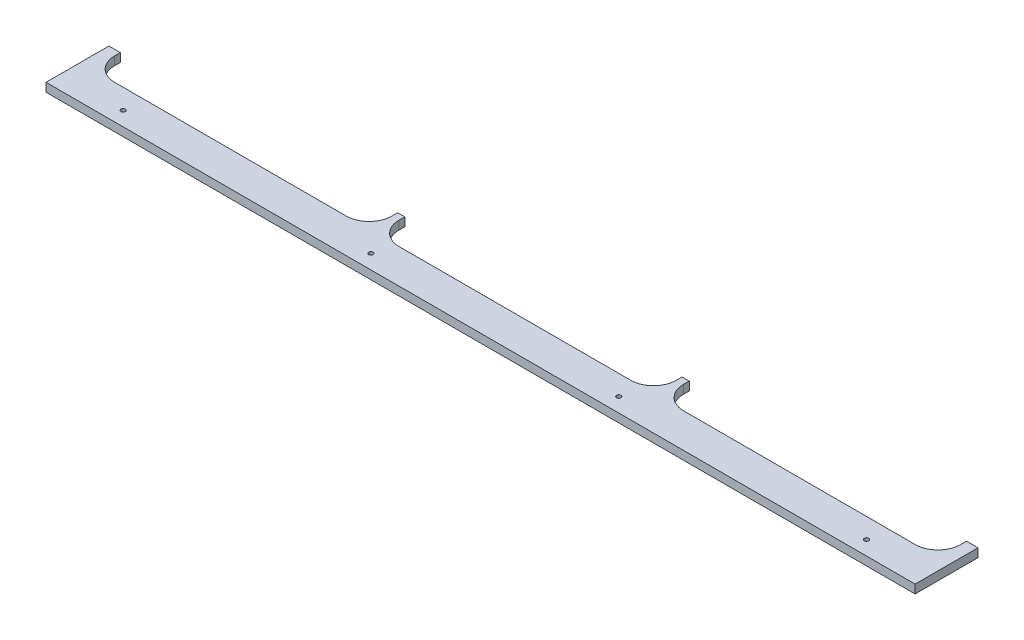
ISO-10303-21;
HEADER;
FILE_DESCRIPTION(('STEP AP214'),'2;1');
FILE_NAME('part.step','',(''),(''),'','','');
FILE_SCHEMA(('AUTOMOTIVE_DESIGN { 1 0 10303 214 1 1 1 1 }'));
ENDSEC;
DATA;
#1=APPLICATION_CONTEXT('core data for automotive mechanical design processes');
#2=APPLICATION_PROTOCOL_DEFINITION('international standard','automotive_design',2000,#1);
#3=PRODUCT_CONTEXT('',#1,'mechanical');
#4=PRODUCT('Part','Part','',(#3));
#5=PRODUCT_RELATED_PRODUCT_CATEGORY('part','',(#4));
#6=PRODUCT_DEFINITION_FORMATION('','',#4);
#7=PRODUCT_DEFINITION_CONTEXT('part definition',#1,'design');
#8=PRODUCT_DEFINITION('design','',#6,#7);
#9=PRODUCT_DEFINITION_SHAPE('','',#8);
#10=(LENGTH_UNIT() NAMED_UNIT(*) SI_UNIT(.MILLI.,.METRE.));
#11=(NAMED_UNIT(*) PLANE_ANGLE_UNIT() SI_UNIT($,.RADIAN.));
#12=(NAMED_UNIT(*) SI_UNIT($,.STERADIAN.) SOLID_ANGLE_UNIT());
#13=UNCERTAINTY_MEASURE_WITH_UNIT(LENGTH_MEASURE(1.E-05),#10,'distance_accuracy_value','');
#14=(GEOMETRIC_REPRESENTATION_CONTEXT(3) GLOBAL_UNCERTAINTY_ASSIGNED_CONTEXT((#13)) GLOBAL_UNIT_ASSIGNED_CONTEXT((#10,
#11,#12)) REPRESENTATION_CONTEXT('',''));
#15=CARTESIAN_POINT('',(0.,0.,0.));
#16=DIRECTION('',(0.,0.,1.));
#17=DIRECTION('',(1.,0.,0.));
#18=AXIS2_PLACEMENT_3D('',#15,#16,#17);
#19=CARTESIAN_POINT('',(38.0999999999999,9.525,-63.4999999999999));
#20=DIRECTION('',(0.,1.,0.));
#21=DIRECTION('',(0.,0.,1.));
#22=AXIS2_PLACEMENT_3D('',#19,#20,#21);
#23=PLANE('',#22);
#24=CARTESIAN_POINT('',(895.35,9.525,-15.875));
#25=DIRECTION('',(0.,1.,0.));
#26=DIRECTION('',(0.,0.,-1.));
#27=AXIS2_PLACEMENT_3D('',#24,#25,#26);
#28=CIRCLE('',#27,2.45744999999989);
#29=CARTESIAN_POINT('',(895.35,9.525,-18.3324499999999));
#30=VERTEX_POINT('',#29);
#31=EDGE_CURVE('E425',#30,#30,#28,.T.);
#32=ORIENTED_EDGE('',*,*,#31,.F.);
#33=EDGE_LOOP('',(#32));
#34=FACE_BOUND('',#33,.T.);
#35=CARTESIAN_POINT('',(69.85,9.525,-15.875));
#36=DIRECTION('',(0.,1.,0.));
#37=DIRECTION('',(0.,0.,1.));
#38=AXIS2_PLACEMENT_3D('',#35,#36,#37);
#39=CIRCLE('',#38,2.45745);
#40=CARTESIAN_POINT('',(69.85,9.525,-13.41755));
#41=VERTEX_POINT('',#40);
#42=EDGE_CURVE('E222',#41,#41,#39,.T.);
#43=ORIENTED_EDGE('',*,*,#42,.F.);
#44=EDGE_LOOP('',(#43));
#45=FACE_BOUND('',#44,.T.);
#46=DIRECTION('',(0.,0.,1.));
#47=VECTOR('',#46,1.);
#48=CARTESIAN_POINT('',(0.,9.525,0.));
#49=LINE('',#48,#47);
#50=CARTESIAN_POINT('',(0.,9.525,-69.85));
#51=VERTEX_POINT('',#50);
#52=CARTESIAN_POINT('',(0.,9.525,0.));
#53=VERTEX_POINT('',#52);
#54=EDGE_CURVE('E261',#51,#53,#49,.T.);
#55=ORIENTED_EDGE('',*,*,#54,.T.);
#56=DIRECTION('',(1.,0.,0.));
#57=VECTOR('',#56,1.);
#58=CARTESIAN_POINT('',(0.,9.525,0.));
#59=LINE('',#58,#57);
#60=CARTESIAN_POINT('',(965.2,9.525,0.));
#61=VERTEX_POINT('',#60);
#62=EDGE_CURVE('E139',#53,#61,#59,.T.);
#63=ORIENTED_EDGE('',*,*,#62,.T.);
#64=DIRECTION('',(0.,0.,-1.));
#65=VECTOR('',#64,1.);
#66=CARTESIAN_POINT('',(965.2,9.525,0.));
#67=LINE('',#66,#65);
#68=CARTESIAN_POINT('',(965.2,9.525,-69.85));
#69=VERTEX_POINT('',#68);
#70=EDGE_CURVE('E318',#61,#69,#67,.T.);
#71=ORIENTED_EDGE('',*,*,#70,.T.);
#72=DIRECTION('',(-1.,0.,0.));
#73=VECTOR('',#72,1.);
#74=CARTESIAN_POINT('',(952.5,9.525,-69.85));
#75=LINE('',#74,#73);
#76=CARTESIAN_POINT('',(952.5,9.525,-69.85));
#77=VERTEX_POINT('',#76);
#78=EDGE_CURVE('E337',#69,#77,#75,.T.);
#79=ORIENTED_EDGE('',*,*,#78,.T.);
#80=DIRECTION('',(0.,0.,1.));
#81=VECTOR('',#80,1.);
#82=CARTESIAN_POINT('',(952.5,9.525,-63.5));
#83=LINE('',#82,#81);
#84=CARTESIAN_POINT('',(952.5,9.525,-63.5));
#85=VERTEX_POINT('',#84);
#86=EDGE_CURVE('E334',#77,#85,#83,.T.);
#87=ORIENTED_EDGE('',*,*,#86,.T.);
#88=CARTESIAN_POINT('',(927.1,9.525,-63.5));
#89=DIRECTION('',(0.,-1.,0.));
#90=DIRECTION('',(0.,0.,1.));
#91=AXIS2_PLACEMENT_3D('',#88,#89,#90);
#92=CIRCLE('',#91,25.4);
#93=CARTESIAN_POINT('',(927.1,9.525,-38.1));
#94=VERTEX_POINT('',#93);
#95=EDGE_CURVE('E336',#85,#94,#92,.T.);
#96=ORIENTED_EDGE('',*,*,#95,.T.);
#97=DIRECTION('',(-1.,0.,0.));
#98=VECTOR('',#97,1.);
#99=CARTESIAN_POINT('',(669.925,9.525,-38.1));
#100=LINE('',#99,#98);
#101=CARTESIAN_POINT('',(669.925,9.525,-38.1));
#102=VERTEX_POINT('',#101);
#103=EDGE_CURVE('E339',#94,#102,#100,.T.);
#104=ORIENTED_EDGE('',*,*,#103,.T.);
#105=CARTESIAN_POINT('',(669.925,9.525,-63.5));
#106=DIRECTION('',(0.,-1.,0.));
#107=DIRECTION('',(0.,0.,-1.));
#108=AXIS2_PLACEMENT_3D('',#105,#106,#107);
#109=CIRCLE('',#108,25.4);
#110=CARTESIAN_POINT('',(644.525,9.525,-63.5));
#111=VERTEX_POINT('',#110);
#112=EDGE_CURVE('E345',#102,#111,#109,.T.);
#113=ORIENTED_EDGE('',*,*,#112,.T.);
#114=DIRECTION('',(0.,0.,-1.));
#115=VECTOR('',#114,1.);
#116=CARTESIAN_POINT('',(644.525,9.525,-63.5));
#117=LINE('',#116,#115);
#118=CARTESIAN_POINT('',(644.525,9.525,-69.85));
#119=VERTEX_POINT('',#118);
#120=EDGE_CURVE('E347',#111,#119,#117,.T.);
#121=ORIENTED_EDGE('',*,*,#120,.T.);
#122=DIRECTION('',(-1.,0.,0.));
#123=VECTOR('',#122,1.);
#124=CARTESIAN_POINT('',(636.5875,9.525,-69.85));
#125=LINE('',#124,#123);
#126=CARTESIAN_POINT('',(636.5875,9.525,-69.85));
#127=VERTEX_POINT('',#126);
#128=EDGE_CURVE('E349',#119,#127,#125,.T.);
#129=ORIENTED_EDGE('',*,*,#128,.T.);
#130=DIRECTION('',(0.,0.,1.));
#131=VECTOR('',#130,1.);
#132=CARTESIAN_POINT('',(636.5875,9.525,-69.85));
#133=LINE('',#132,#131);
#134=CARTESIAN_POINT('',(636.5875,9.525,-63.5));
#135=VERTEX_POINT('',#134);
#136=EDGE_CURVE('E351',#127,#135,#133,.T.);
#137=ORIENTED_EDGE('',*,*,#136,.T.);
#138=CARTESIAN_POINT('',(611.1875,9.525,-63.5));
#139=DIRECTION('',(0.,-1.,0.));
#140=DIRECTION('',(0.,0.,1.));
#141=AXIS2_PLACEMENT_3D('',#138,#139,#140);
#142=CIRCLE('',#141,25.4);
#143=CARTESIAN_POINT('',(611.1875,9.525,-38.1));
#144=VERTEX_POINT('',#143);
#145=EDGE_CURVE('E353',#135,#144,#142,.T.);
#146=ORIENTED_EDGE('',*,*,#145,.T.);
#147=DIRECTION('',(-1.,0.,0.));
#148=VECTOR('',#147,1.);
#149=CARTESIAN_POINT('',(354.0125,9.525,-38.1));
#150=LINE('',#149,#148);
#151=CARTESIAN_POINT('',(354.0125,9.525,-38.1));
#152=VERTEX_POINT('',#151);
#153=EDGE_CURVE('E355',#144,#152,#150,.T.);
#154=ORIENTED_EDGE('',*,*,#153,.T.);
#155=CARTESIAN_POINT('',(354.0125,9.525,-63.5));
#156=DIRECTION('',(0.,-1.,0.));
#157=DIRECTION('',(0.,0.,1.));
#158=AXIS2_PLACEMENT_3D('',#155,#156,#157);
#159=CIRCLE('',#158,25.4);
#160=CARTESIAN_POINT('',(328.6125,9.525,-63.5));
#161=VERTEX_POINT('',#160);
#162=EDGE_CURVE('E357',#152,#161,#159,.T.);
#163=ORIENTED_EDGE('',*,*,#162,.T.);
#164=DIRECTION('',(0.,0.,-1.));
#165=VECTOR('',#164,1.);
#166=CARTESIAN_POINT('',(328.6125,9.525,-69.85));
#167=LINE('',#166,#165);
#168=CARTESIAN_POINT('',(328.6125,9.525,-69.85));
#169=VERTEX_POINT('',#168);
#170=EDGE_CURVE('E359',#161,#169,#167,.T.);
#171=ORIENTED_EDGE('',*,*,#170,.T.);
#172=DIRECTION('',(-1.,0.,0.));
#173=VECTOR('',#172,1.);
#174=CARTESIAN_POINT('',(328.6125,9.525,-69.85));
#175=LINE('',#174,#173);
#176=CARTESIAN_POINT('',(320.675,9.525,-69.85));
#177=VERTEX_POINT('',#176);
#178=EDGE_CURVE('E361',#169,#177,#175,.T.);
#179=ORIENTED_EDGE('',*,*,#178,.T.);
#180=DIRECTION('',(0.,0.,1.));
#181=VECTOR('',#180,1.);
#182=CARTESIAN_POINT('',(320.675,9.525,-69.85));
#183=LINE('',#182,#181);
#184=CARTESIAN_POINT('',(320.675,9.525,-63.5000000000001));
#185=VERTEX_POINT('',#184);
#186=EDGE_CURVE('E363',#177,#185,#183,.T.);
#187=ORIENTED_EDGE('',*,*,#186,.T.);
#188=CARTESIAN_POINT('',(295.275,9.525,-63.4999999999999));
#189=DIRECTION('',(0.,-1.,0.));
#190=DIRECTION('',(0.,0.,1.));
#191=AXIS2_PLACEMENT_3D('',#188,#189,#190);
#192=CIRCLE('',#191,25.4);
#193=CARTESIAN_POINT('',(295.275,9.525,-38.1));
#194=VERTEX_POINT('',#193);
#195=EDGE_CURVE('E365',#185,#194,#192,.T.);
#196=ORIENTED_EDGE('',*,*,#195,.T.);
#197=DIRECTION('',(-1.,0.,0.));
#198=VECTOR('',#197,1.);
#199=CARTESIAN_POINT('',(38.1000000000001,9.525,-38.1));
#200=LINE('',#199,#198);
#201=CARTESIAN_POINT('',(38.1000000000001,9.525,-38.1));
#202=VERTEX_POINT('',#201);
#203=EDGE_CURVE('E200',#194,#202,#200,.T.);
#204=ORIENTED_EDGE('',*,*,#203,.T.);
#205=CARTESIAN_POINT('',(38.0999999999999,9.525,-63.4999999999999));
#206=DIRECTION('',(0.,-1.,0.));
#207=DIRECTION('',(0.,0.,1.));
#208=AXIS2_PLACEMENT_3D('',#205,#206,#207);
#209=CIRCLE('',#208,25.4);
#210=CARTESIAN_POINT('',(12.6999999999999,9.525,-63.5000000000002));
#211=VERTEX_POINT('',#210);
#212=EDGE_CURVE('E194',#202,#211,#209,.T.);
#213=ORIENTED_EDGE('',*,*,#212,.T.);
#214=DIRECTION('',(0.,0.,-1.));
#215=VECTOR('',#214,1.);
#216=CARTESIAN_POINT('',(12.6999999999999,9.525,-69.85));
#217=LINE('',#216,#215);
#218=CARTESIAN_POINT('',(12.6999999999999,9.525,-69.85));
#219=VERTEX_POINT('',#218);
#220=EDGE_CURVE('E198',#211,#219,#217,.T.);
#221=ORIENTED_EDGE('',*,*,#220,.T.);
#222=DIRECTION('',(-1.,0.,0.));
#223=VECTOR('',#222,1.);
#224=CARTESIAN_POINT('',(12.6999999999999,9.525,-69.85));
#225=LINE('',#224,#223);
#226=EDGE_CURVE('E54',#219,#51,#225,.T.);
#227=ORIENTED_EDGE('',*,*,#226,.T.);
#228=EDGE_LOOP('',(#55,#63,#71,#79,#87,#96,#104,#113,#121,#129,#137,#146,#154,#163,#171,#179,
#187,#196,#204,#213,#221,#227));
#229=FACE_BOUND('',#228,.T.);
#230=CARTESIAN_POINT('',(345.01582,9.525,-15.875));
#231=DIRECTION('',(0.,1.,0.));
#232=DIRECTION('',(0.,0.,1.));
#233=AXIS2_PLACEMENT_3D('',#230,#231,#232);
#234=CIRCLE('',#233,2.45745000000002);
#235=CARTESIAN_POINT('',(345.01582,9.525,-13.41755));
#236=VERTEX_POINT('',#235);
#237=EDGE_CURVE('E431',#236,#236,#234,.T.);
#238=ORIENTED_EDGE('',*,*,#237,.F.);
#239=EDGE_LOOP('',(#238));
#240=FACE_BOUND('',#239,.T.);
#241=CARTESIAN_POINT('',(620.18418,9.525,-15.875));
#242=DIRECTION('',(0.,1.,0.));
#243=DIRECTION('',(0.,0.,-1.));
#244=AXIS2_PLACEMENT_3D('',#241,#242,#243);
#245=CIRCLE('',#244,2.45745000000001);
#246=CARTESIAN_POINT('',(620.18418,9.525,-18.33245));
#247=VERTEX_POINT('',#246);
#248=EDGE_CURVE('E416',#247,#247,#245,.T.);
#249=ORIENTED_EDGE('',*,*,#248,.F.);
#250=EDGE_LOOP('',(#249));
#251=FACE_BOUND('',#250,.T.);
#252=ADVANCED_FACE('F37',(#34,#45,#229,#240,#251),#23,.T.);
#253=CARTESIAN_POINT('',(38.0999999999999,0.,-63.4999999999999));
#254=DIRECTION('',(0.,1.,0.));
#255=DIRECTION('',(0.,0.,1.));
#256=AXIS2_PLACEMENT_3D('',#253,#254,#255);
#257=PLANE('',#256);
#258=DIRECTION('',(0.,0.,1.));
#259=VECTOR('',#258,1.);
#260=CARTESIAN_POINT('',(0.,0.,0.));
#261=LINE('',#260,#259);
#262=CARTESIAN_POINT('',(0.,0.,-69.85));
#263=VERTEX_POINT('',#262);
#264=CARTESIAN_POINT('',(0.,0.,0.));
#265=VERTEX_POINT('',#264);
#266=EDGE_CURVE('E218',#263,#265,#261,.T.);
#267=ORIENTED_EDGE('',*,*,#266,.F.);
#268=DIRECTION('',(-1.,0.,0.));
#269=VECTOR('',#268,1.);
#270=CARTESIAN_POINT('',(12.6999999999999,0.,-69.85));
#271=LINE('',#270,#269);
#272=CARTESIAN_POINT('',(12.6999999999999,0.,-69.85));
#273=VERTEX_POINT('',#272);
#274=EDGE_CURVE('E131',#273,#263,#271,.T.);
#275=ORIENTED_EDGE('',*,*,#274,.F.);
#276=DIRECTION('',(0.,0.,-1.));
#277=VECTOR('',#276,1.);
#278=CARTESIAN_POINT('',(12.6999999999999,0.,-69.85));
#279=LINE('',#278,#277);
#280=CARTESIAN_POINT('',(12.6999999999999,0.,-63.5000000000002));
#281=VERTEX_POINT('',#280);
#282=EDGE_CURVE('E125',#281,#273,#279,.T.);
#283=ORIENTED_EDGE('',*,*,#282,.F.);
#284=CARTESIAN_POINT('',(38.0999999999999,0.,-63.4999999999999));
#285=DIRECTION('',(0.,-1.,0.));
#286=DIRECTION('',(0.,0.,1.));
#287=AXIS2_PLACEMENT_3D('',#284,#285,#286);
#288=CIRCLE('',#287,25.4);
#289=CARTESIAN_POINT('',(38.1000000000001,0.,-38.1));
#290=VERTEX_POINT('',#289);
#291=EDGE_CURVE('E208',#290,#281,#288,.T.);
#292=ORIENTED_EDGE('',*,*,#291,.F.);
#293=DIRECTION('',(-1.,0.,0.));
#294=VECTOR('',#293,1.);
#295=CARTESIAN_POINT('',(38.1000000000001,0.,-38.1));
#296=LINE('',#295,#294);
#297=CARTESIAN_POINT('',(295.275,0.,-38.1));
#298=VERTEX_POINT('',#297);
#299=EDGE_CURVE('E256',#298,#290,#296,.T.);
#300=ORIENTED_EDGE('',*,*,#299,.F.);
#301=CARTESIAN_POINT('',(295.275,0.,-63.4999999999999));
#302=DIRECTION('',(0.,-1.,0.));
#303=DIRECTION('',(0.,0.,1.));
#304=AXIS2_PLACEMENT_3D('',#301,#302,#303);
#305=CIRCLE('',#304,25.4);
#306=CARTESIAN_POINT('',(320.675,0.,-63.5000000000001));
#307=VERTEX_POINT('',#306);
#308=EDGE_CURVE('E254',#307,#298,#305,.T.);
#309=ORIENTED_EDGE('',*,*,#308,.F.);
#310=DIRECTION('',(0.,0.,1.));
#311=VECTOR('',#310,1.);
#312=CARTESIAN_POINT('',(320.675,0.,-69.85));
#313=LINE('',#312,#311);
#314=CARTESIAN_POINT('',(320.675,0.,-69.85));
#315=VERTEX_POINT('',#314);
#316=EDGE_CURVE('E252',#315,#307,#313,.T.);
#317=ORIENTED_EDGE('',*,*,#316,.F.);
#318=DIRECTION('',(-1.,0.,0.));
#319=VECTOR('',#318,1.);
#320=CARTESIAN_POINT('',(328.6125,0.,-69.85));
#321=LINE('',#320,#319);
#322=CARTESIAN_POINT('',(328.6125,0.,-69.85));
#323=VERTEX_POINT('',#322);
#324=EDGE_CURVE('E250',#323,#315,#321,.T.);
#325=ORIENTED_EDGE('',*,*,#324,.F.);
#326=DIRECTION('',(0.,0.,-1.));
#327=VECTOR('',#326,1.);
#328=CARTESIAN_POINT('',(328.6125,0.,-69.85));
#329=LINE('',#328,#327);
#330=CARTESIAN_POINT('',(328.6125,0.,-63.5));
#331=VERTEX_POINT('',#330);
#332=EDGE_CURVE('E248',#331,#323,#329,.T.);
#333=ORIENTED_EDGE('',*,*,#332,.F.);
#334=CARTESIAN_POINT('',(354.0125,0.,-63.5));
#335=DIRECTION('',(0.,-1.,0.));
#336=DIRECTION('',(0.,0.,1.));
#337=AXIS2_PLACEMENT_3D('',#334,#335,#336);
#338=CIRCLE('',#337,25.4);
#339=CARTESIAN_POINT('',(354.0125,0.,-38.1));
#340=VERTEX_POINT('',#339);
#341=EDGE_CURVE('E246',#340,#331,#338,.T.);
#342=ORIENTED_EDGE('',*,*,#341,.F.);
#343=DIRECTION('',(-1.,0.,0.));
#344=VECTOR('',#343,1.);
#345=CARTESIAN_POINT('',(354.0125,0.,-38.1));
#346=LINE('',#345,#344);
#347=CARTESIAN_POINT('',(611.1875,0.,-38.1));
#348=VERTEX_POINT('',#347);
#349=EDGE_CURVE('E244',#348,#340,#346,.T.);
#350=ORIENTED_EDGE('',*,*,#349,.F.);
#351=CARTESIAN_POINT('',(611.1875,0.,-63.5));
#352=DIRECTION('',(0.,-1.,0.));
#353=DIRECTION('',(0.,0.,1.));
#354=AXIS2_PLACEMENT_3D('',#351,#352,#353);
#355=CIRCLE('',#354,25.4);
#356=CARTESIAN_POINT('',(636.5875,0.,-63.5));
#357=VERTEX_POINT('',#356);
#358=EDGE_CURVE('E242',#357,#348,#355,.T.);
#359=ORIENTED_EDGE('',*,*,#358,.F.);
#360=DIRECTION('',(0.,0.,1.));
#361=VECTOR('',#360,1.);
#362=CARTESIAN_POINT('',(636.5875,0.,-69.85));
#363=LINE('',#362,#361);
#364=CARTESIAN_POINT('',(636.5875,0.,-69.85));
#365=VERTEX_POINT('',#364);
#366=EDGE_CURVE('E240',#365,#357,#363,.T.);
#367=ORIENTED_EDGE('',*,*,#366,.F.);
#368=DIRECTION('',(-1.,0.,0.));
#369=VECTOR('',#368,1.);
#370=CARTESIAN_POINT('',(636.5875,0.,-69.85));
#371=LINE('',#370,#369);
#372=CARTESIAN_POINT('',(644.525,0.,-69.85));
#373=VERTEX_POINT('',#372);
#374=EDGE_CURVE('E238',#373,#365,#371,.T.);
#375=ORIENTED_EDGE('',*,*,#374,.F.);
#376=DIRECTION('',(0.,0.,-1.));
#377=VECTOR('',#376,1.);
#378=CARTESIAN_POINT('',(644.525,0.,-63.5));
#379=LINE('',#378,#377);
#380=CARTESIAN_POINT('',(644.525,0.,-63.5));
#381=VERTEX_POINT('',#380);
#382=EDGE_CURVE('E236',#381,#373,#379,.T.);
#383=ORIENTED_EDGE('',*,*,#382,.F.);
#384=CARTESIAN_POINT('',(669.925,0.,-63.5));
#385=DIRECTION('',(0.,-1.,0.));
#386=DIRECTION('',(0.,0.,-1.));
#387=AXIS2_PLACEMENT_3D('',#384,#385,#386);
#388=CIRCLE('',#387,25.4);
#389=CARTESIAN_POINT('',(669.925,0.,-38.1));
#390=VERTEX_POINT('',#389);
#391=EDGE_CURVE('E234',#390,#381,#388,.T.);
#392=ORIENTED_EDGE('',*,*,#391,.F.);
#393=DIRECTION('',(-1.,0.,0.));
#394=VECTOR('',#393,1.);
#395=CARTESIAN_POINT('',(669.925,0.,-38.1));
#396=LINE('',#395,#394);
#397=CARTESIAN_POINT('',(927.1,0.,-38.1));
#398=VERTEX_POINT('',#397);
#399=EDGE_CURVE('E232',#398,#390,#396,.T.);
#400=ORIENTED_EDGE('',*,*,#399,.F.);
#401=CARTESIAN_POINT('',(927.1,0.,-63.5));
#402=DIRECTION('',(0.,-1.,0.));
#403=DIRECTION('',(0.,0.,1.));
#404=AXIS2_PLACEMENT_3D('',#401,#402,#403);
#405=CIRCLE('',#404,25.4);
#406=CARTESIAN_POINT('',(952.5,0.,-63.5));
#407=VERTEX_POINT('',#406);
#408=EDGE_CURVE('E230',#407,#398,#405,.T.);
#409=ORIENTED_EDGE('',*,*,#408,.F.);
#410=DIRECTION('',(0.,0.,1.));
#411=VECTOR('',#410,1.);
#412=CARTESIAN_POINT('',(952.5,0.,-63.5));
#413=LINE('',#412,#411);
#414=CARTESIAN_POINT('',(952.5,0.,-69.85));
#415=VERTEX_POINT('',#414);
#416=EDGE_CURVE('E228',#415,#407,#413,.T.);
#417=ORIENTED_EDGE('',*,*,#416,.F.);
#418=DIRECTION('',(-1.,0.,0.));
#419=VECTOR('',#418,1.);
#420=CARTESIAN_POINT('',(952.5,0.,-69.85));
#421=LINE('',#420,#419);
#422=CARTESIAN_POINT('',(965.2,0.,-69.85));
#423=VERTEX_POINT('',#422);
#424=EDGE_CURVE('E226',#423,#415,#421,.T.);
#425=ORIENTED_EDGE('',*,*,#424,.F.);
#426=DIRECTION('',(0.,0.,-1.));
#427=VECTOR('',#426,1.);
#428=CARTESIAN_POINT('',(965.2,0.,0.));
#429=LINE('',#428,#427);
#430=CARTESIAN_POINT('',(965.2,0.,0.));
#431=VERTEX_POINT('',#430);
#432=EDGE_CURVE('E224',#431,#423,#429,.T.);
#433=ORIENTED_EDGE('',*,*,#432,.F.);
#434=DIRECTION('',(1.,0.,0.));
#435=VECTOR('',#434,1.);
#436=CARTESIAN_POINT('',(0.,0.,0.));
#437=LINE('',#436,#435);
#438=EDGE_CURVE('E221',#265,#431,#437,.T.);
#439=ORIENTED_EDGE('',*,*,#438,.F.);
#440=EDGE_LOOP('',(#267,#275,#283,#292,#300,#309,#317,#325,#333,#342,#350,#359,#367,#375,#383,
#392,#400,#409,#417,#425,#433,#439));
#441=FACE_BOUND('',#440,.T.);
#442=CARTESIAN_POINT('',(69.85,0.,-15.875));
#443=DIRECTION('',(0.,1.,0.));
#444=DIRECTION('',(0.,0.,1.));
#445=AXIS2_PLACEMENT_3D('',#442,#443,#444);
#446=CIRCLE('',#445,2.45745);
#447=CARTESIAN_POINT('',(69.85,0.,-13.41755));
#448=VERTEX_POINT('',#447);
#449=EDGE_CURVE('E434',#448,#448,#446,.T.);
#450=ORIENTED_EDGE('',*,*,#449,.T.);
#451=EDGE_LOOP('',(#450));
#452=FACE_BOUND('',#451,.T.);
#453=CARTESIAN_POINT('',(345.01582,0.,-15.875));
#454=DIRECTION('',(0.,1.,0.));
#455=DIRECTION('',(0.,0.,1.));
#456=AXIS2_PLACEMENT_3D('',#453,#454,#455);
#457=CIRCLE('',#456,2.45745000000002);
#458=CARTESIAN_POINT('',(345.01582,0.,-13.41755));
#459=VERTEX_POINT('',#458);
#460=EDGE_CURVE('E428',#459,#459,#457,.T.);
#461=ORIENTED_EDGE('',*,*,#460,.T.);
#462=EDGE_LOOP('',(#461));
#463=FACE_BOUND('',#462,.T.);
#464=CARTESIAN_POINT('',(895.35,0.,-15.875));
#465=DIRECTION('',(0.,1.,0.));
#466=DIRECTION('',(0.,0.,-1.));
#467=AXIS2_PLACEMENT_3D('',#464,#465,#466);
#468=CIRCLE('',#467,2.45744999999989);
#469=CARTESIAN_POINT('',(895.35,0.,-18.3324499999999));
#470=VERTEX_POINT('',#469);
#471=EDGE_CURVE('E422',#470,#470,#468,.T.);
#472=ORIENTED_EDGE('',*,*,#471,.T.);
#473=EDGE_LOOP('',(#472));
#474=FACE_BOUND('',#473,.T.);
#475=CARTESIAN_POINT('',(620.18418,0.,-15.875));
#476=DIRECTION('',(0.,1.,0.));
#477=DIRECTION('',(0.,0.,-1.));
#478=AXIS2_PLACEMENT_3D('',#475,#476,#477);
#479=CIRCLE('',#478,2.45745000000001);
#480=CARTESIAN_POINT('',(620.18418,0.,-18.33245));
#481=VERTEX_POINT('',#480);
#482=EDGE_CURVE('E419',#481,#481,#479,.T.);
#483=ORIENTED_EDGE('',*,*,#482,.T.);
#484=EDGE_LOOP('',(#483));
#485=FACE_BOUND('',#484,.T.);
#486=ADVANCED_FACE('F322',(#441,#452,#463,#474,#485),#257,.F.);
#487=CARTESIAN_POINT('',(0.,9.525,0.));
#488=DIRECTION('',(1.,0.,0.));
#489=DIRECTION('',(0.,0.,-1.));
#490=AXIS2_PLACEMENT_3D('',#487,#488,#489);
#491=PLANE('',#490);
#492=ORIENTED_EDGE('',*,*,#266,.T.);
#493=DIRECTION('',(0.,-1.,0.));
#494=VECTOR('',#493,1.);
#495=CARTESIAN_POINT('',(0.,9.525,0.));
#496=LINE('',#495,#494);
#497=EDGE_CURVE('E11',#53,#265,#496,.T.);
#498=ORIENTED_EDGE('',*,*,#497,.F.);
#499=ORIENTED_EDGE('',*,*,#54,.F.);
#500=DIRECTION('',(0.,-1.,0.));
#501=VECTOR('',#500,1.);
#502=CARTESIAN_POINT('',(0.,9.525,-69.85));
#503=LINE('',#502,#501);
#504=EDGE_CURVE('E214',#51,#263,#503,.T.);
#505=ORIENTED_EDGE('',*,*,#504,.T.);
#506=EDGE_LOOP('',(#492,#498,#499,#505));
#507=FACE_BOUND('',#506,.T.);
#508=ADVANCED_FACE('F39',(#507),#491,.F.);
#509=CARTESIAN_POINT('',(0.,9.525,0.));
#510=DIRECTION('',(0.,0.,-1.));
#511=DIRECTION('',(-1.,0.,0.));
#512=AXIS2_PLACEMENT_3D('',#509,#510,#511);
#513=PLANE('',#512);
#514=ORIENTED_EDGE('',*,*,#438,.T.);
#515=DIRECTION('',(0.,-1.,0.));
#516=VECTOR('',#515,1.);
#517=CARTESIAN_POINT('',(965.2,9.525,0.));
#518=LINE('',#517,#516);
#519=EDGE_CURVE('E46',#61,#431,#518,.T.);
#520=ORIENTED_EDGE('',*,*,#519,.F.);
#521=ORIENTED_EDGE('',*,*,#62,.F.);
#522=ORIENTED_EDGE('',*,*,#497,.T.);
#523=EDGE_LOOP('',(#514,#520,#521,#522));
#524=FACE_BOUND('',#523,.T.);
#525=ADVANCED_FACE('F664',(#524),#513,.F.);
#526=CARTESIAN_POINT('',(965.2,9.525,0.));
#527=DIRECTION('',(-1.,0.,0.));
#528=DIRECTION('',(0.,0.,1.));
#529=AXIS2_PLACEMENT_3D('',#526,#527,#528);
#530=PLANE('',#529);
#531=ORIENTED_EDGE('',*,*,#432,.T.);
#532=DIRECTION('',(0.,-1.,0.));
#533=VECTOR('',#532,1.);
#534=CARTESIAN_POINT('',(965.2,9.525,-69.85));
#535=LINE('',#534,#533);
#536=EDGE_CURVE('E310',#69,#423,#535,.T.);
#537=ORIENTED_EDGE('',*,*,#536,.F.);
#538=ORIENTED_EDGE('',*,*,#70,.F.);
#539=ORIENTED_EDGE('',*,*,#519,.T.);
#540=EDGE_LOOP('',(#531,#537,#538,#539));
#541=FACE_BOUND('',#540,.T.);
#542=ADVANCED_FACE('F316',(#541),#530,.F.);
#543=CARTESIAN_POINT('',(952.5,9.525,-69.85));
#544=DIRECTION('',(0.,0.,1.));
#545=DIRECTION('',(1.,0.,0.));
#546=AXIS2_PLACEMENT_3D('',#543,#544,#545);
#547=PLANE('',#546);
#548=ORIENTED_EDGE('',*,*,#424,.T.);
#549=DIRECTION('',(0.,-1.,0.));
#550=VECTOR('',#549,1.);
#551=CARTESIAN_POINT('',(952.5,9.525,-69.85));
#552=LINE('',#551,#550);
#553=EDGE_CURVE('E307',#77,#415,#552,.T.);
#554=ORIENTED_EDGE('',*,*,#553,.F.);
#555=ORIENTED_EDGE('',*,*,#78,.F.);
#556=ORIENTED_EDGE('',*,*,#536,.T.);
#557=EDGE_LOOP('',(#548,#554,#555,#556));
#558=FACE_BOUND('',#557,.T.);
#559=ADVANCED_FACE('F328',(#558),#547,.F.);
#560=CARTESIAN_POINT('',(952.5,9.525,-63.5));
#561=DIRECTION('',(1.,0.,0.));
#562=DIRECTION('',(0.,0.,-1.));
#563=AXIS2_PLACEMENT_3D('',#560,#561,#562);
#564=PLANE('',#563);
#565=ORIENTED_EDGE('',*,*,#416,.T.);
#566=DIRECTION('',(0.,-1.,0.));
#567=VECTOR('',#566,1.);
#568=CARTESIAN_POINT('',(952.5,9.525,-63.5));
#569=LINE('',#568,#567);
#570=EDGE_CURVE('E304',#85,#407,#569,.T.);
#571=ORIENTED_EDGE('',*,*,#570,.F.);
#572=ORIENTED_EDGE('',*,*,#86,.F.);
#573=ORIENTED_EDGE('',*,*,#553,.T.);
#574=EDGE_LOOP('',(#565,#571,#572,#573));
#575=FACE_BOUND('',#574,.T.);
#576=ADVANCED_FACE('F332',(#575),#564,.F.);
#577=CARTESIAN_POINT('',(927.1,9.525,-63.5));
#578=DIRECTION('',(0.,-1.,0.));
#579=DIRECTION('',(0.,0.,-1.));
#580=AXIS2_PLACEMENT_3D('',#577,#578,#579);
#581=CYLINDRICAL_SURFACE('',#580,25.4);
#582=ORIENTED_EDGE('',*,*,#408,.T.);
#583=DIRECTION('',(0.,-1.,0.));
#584=VECTOR('',#583,1.);
#585=CARTESIAN_POINT('',(927.1,9.525,-38.1));
#586=LINE('',#585,#584);
#587=EDGE_CURVE('E301',#94,#398,#586,.T.);
#588=ORIENTED_EDGE('',*,*,#587,.F.);
#589=ORIENTED_EDGE('',*,*,#95,.F.);
#590=ORIENTED_EDGE('',*,*,#570,.T.);
#591=EDGE_LOOP('',(#582,#588,#589,#590));
#592=FACE_BOUND('',#591,.T.);
#593=ADVANCED_FACE('F625',(#592),#581,.F.);
#594=CARTESIAN_POINT('',(669.925,9.525,-38.1));
#595=DIRECTION('',(0.,0.,1.));
#596=DIRECTION('',(1.,0.,0.));
#597=AXIS2_PLACEMENT_3D('',#594,#595,#596);
#598=PLANE('',#597);
#599=ORIENTED_EDGE('',*,*,#399,.T.);
#600=DIRECTION('',(0.,-1.,0.));
#601=VECTOR('',#600,1.);
#602=CARTESIAN_POINT('',(669.925,9.525,-38.1));
#603=LINE('',#602,#601);
#604=EDGE_CURVE('E298',#102,#390,#603,.T.);
#605=ORIENTED_EDGE('',*,*,#604,.F.);
#606=ORIENTED_EDGE('',*,*,#103,.F.);
#607=ORIENTED_EDGE('',*,*,#587,.T.);
#608=EDGE_LOOP('',(#599,#605,#606,#607));
#609=FACE_BOUND('',#608,.T.);
#610=ADVANCED_FACE('F614',(#609),#598,.F.);
#611=CARTESIAN_POINT('',(669.925,9.525,-63.5));
#612=DIRECTION('',(0.,-1.,0.));
#613=DIRECTION('',(0.,0.,-1.));
#614=AXIS2_PLACEMENT_3D('',#611,#612,#613);
#615=CYLINDRICAL_SURFACE('',#614,25.4);
#616=ORIENTED_EDGE('',*,*,#391,.T.);
#617=DIRECTION('',(0.,-1.,0.));
#618=VECTOR('',#617,1.);
#619=CARTESIAN_POINT('',(644.525,9.525,-63.5));
#620=LINE('',#619,#618);
#621=EDGE_CURVE('E295',#111,#381,#620,.T.);
#622=ORIENTED_EDGE('',*,*,#621,.F.);
#623=ORIENTED_EDGE('',*,*,#112,.F.);
#624=ORIENTED_EDGE('',*,*,#604,.T.);
#625=EDGE_LOOP('',(#616,#622,#623,#624));
#626=FACE_BOUND('',#625,.T.);
#627=ADVANCED_FACE('F603',(#626),#615,.F.);
#628=CARTESIAN_POINT('',(644.525,9.525,-63.5));
#629=DIRECTION('',(-1.,0.,0.));
#630=DIRECTION('',(0.,0.,1.));
#631=AXIS2_PLACEMENT_3D('',#628,#629,#630);
#632=PLANE('',#631);
#633=ORIENTED_EDGE('',*,*,#382,.T.);
#634=DIRECTION('',(0.,-1.,0.));
#635=VECTOR('',#634,1.);
#636=CARTESIAN_POINT('',(644.525,9.525,-69.85));
#637=LINE('',#636,#635);
#638=EDGE_CURVE('E292',#119,#373,#637,.T.);
#639=ORIENTED_EDGE('',*,*,#638,.F.);
#640=ORIENTED_EDGE('',*,*,#120,.F.);
#641=ORIENTED_EDGE('',*,*,#621,.T.);
#642=EDGE_LOOP('',(#633,#639,#640,#641));
#643=FACE_BOUND('',#642,.T.);
#644=ADVANCED_FACE('F592',(#643),#632,.F.);
#645=CARTESIAN_POINT('',(636.5875,9.525,-69.85));
#646=DIRECTION('',(0.,0.,1.));
#647=DIRECTION('',(1.,0.,0.));
#648=AXIS2_PLACEMENT_3D('',#645,#646,#647);
#649=PLANE('',#648);
#650=ORIENTED_EDGE('',*,*,#374,.T.);
#651=DIRECTION('',(0.,-1.,0.));
#652=VECTOR('',#651,1.);
#653=CARTESIAN_POINT('',(636.5875,9.525,-69.85));
#654=LINE('',#653,#652);
#655=EDGE_CURVE('E289',#127,#365,#654,.T.);
#656=ORIENTED_EDGE('',*,*,#655,.F.);
#657=ORIENTED_EDGE('',*,*,#128,.F.);
#658=ORIENTED_EDGE('',*,*,#638,.T.);
#659=EDGE_LOOP('',(#650,#656,#657,#658));
#660=FACE_BOUND('',#659,.T.);
#661=ADVANCED_FACE('F581',(#660),#649,.F.);
#662=CARTESIAN_POINT('',(636.5875,9.525,-69.85));
#663=DIRECTION('',(1.,0.,0.));
#664=DIRECTION('',(0.,0.,-1.));
#665=AXIS2_PLACEMENT_3D('',#662,#663,#664);
#666=PLANE('',#665);
#667=ORIENTED_EDGE('',*,*,#366,.T.);
#668=DIRECTION('',(0.,-1.,0.));
#669=VECTOR('',#668,1.);
#670=CARTESIAN_POINT('',(636.5875,9.525,-63.5));
#671=LINE('',#670,#669);
#672=EDGE_CURVE('E286',#135,#357,#671,.T.);
#673=ORIENTED_EDGE('',*,*,#672,.F.);
#674=ORIENTED_EDGE('',*,*,#136,.F.);
#675=ORIENTED_EDGE('',*,*,#655,.T.);
#676=EDGE_LOOP('',(#667,#673,#674,#675));
#677=FACE_BOUND('',#676,.T.);
#678=ADVANCED_FACE('F570',(#677),#666,.F.);
#679=CARTESIAN_POINT('',(611.1875,9.525,-63.5));
#680=DIRECTION('',(0.,-1.,0.));
#681=DIRECTION('',(0.,0.,-1.));
#682=AXIS2_PLACEMENT_3D('',#679,#680,#681);
#683=CYLINDRICAL_SURFACE('',#682,25.4);
#684=ORIENTED_EDGE('',*,*,#358,.T.);
#685=DIRECTION('',(0.,-1.,0.));
#686=VECTOR('',#685,1.);
#687=CARTESIAN_POINT('',(611.1875,9.525,-38.1));
#688=LINE('',#687,#686);
#689=EDGE_CURVE('E283',#144,#348,#688,.T.);
#690=ORIENTED_EDGE('',*,*,#689,.F.);
#691=ORIENTED_EDGE('',*,*,#145,.F.);
#692=ORIENTED_EDGE('',*,*,#672,.T.);
#693=EDGE_LOOP('',(#684,#690,#691,#692));
#694=FACE_BOUND('',#693,.T.);
#695=ADVANCED_FACE('F559',(#694),#683,.F.);
#696=CARTESIAN_POINT('',(354.0125,9.525,-38.1));
#697=DIRECTION('',(0.,0.,1.));
#698=DIRECTION('',(1.,0.,0.));
#699=AXIS2_PLACEMENT_3D('',#696,#697,#698);
#700=PLANE('',#699);
#701=ORIENTED_EDGE('',*,*,#349,.T.);
#702=DIRECTION('',(0.,-1.,0.));
#703=VECTOR('',#702,1.);
#704=CARTESIAN_POINT('',(354.0125,9.525,-38.1));
#705=LINE('',#704,#703);
#706=EDGE_CURVE('E280',#152,#340,#705,.T.);
#707=ORIENTED_EDGE('',*,*,#706,.F.);
#708=ORIENTED_EDGE('',*,*,#153,.F.);
#709=ORIENTED_EDGE('',*,*,#689,.T.);
#710=EDGE_LOOP('',(#701,#707,#708,#709));
#711=FACE_BOUND('',#710,.T.);
#712=ADVANCED_FACE('F548',(#711),#700,.F.);
#713=CARTESIAN_POINT('',(354.0125,9.525,-63.5));
#714=DIRECTION('',(0.,-1.,0.));
#715=DIRECTION('',(0.,0.,-1.));
#716=AXIS2_PLACEMENT_3D('',#713,#714,#715);
#717=CYLINDRICAL_SURFACE('',#716,25.4);
#718=ORIENTED_EDGE('',*,*,#341,.T.);
#719=DIRECTION('',(0.,-1.,0.));
#720=VECTOR('',#719,1.);
#721=CARTESIAN_POINT('',(328.6125,9.525,-63.5));
#722=LINE('',#721,#720);
#723=EDGE_CURVE('E277',#161,#331,#722,.T.);
#724=ORIENTED_EDGE('',*,*,#723,.F.);
#725=ORIENTED_EDGE('',*,*,#162,.F.);
#726=ORIENTED_EDGE('',*,*,#706,.T.);
#727=EDGE_LOOP('',(#718,#724,#725,#726));
#728=FACE_BOUND('',#727,.T.);
#729=ADVANCED_FACE('F537',(#728),#717,.F.);
#730=CARTESIAN_POINT('',(328.6125,9.525,-69.85));
#731=DIRECTION('',(-1.,0.,0.));
#732=DIRECTION('',(0.,0.,1.));
#733=AXIS2_PLACEMENT_3D('',#730,#731,#732);
#734=PLANE('',#733);
#735=ORIENTED_EDGE('',*,*,#332,.T.);
#736=DIRECTION('',(0.,-1.,0.));
#737=VECTOR('',#736,1.);
#738=CARTESIAN_POINT('',(328.6125,9.525,-69.85));
#739=LINE('',#738,#737);
#740=EDGE_CURVE('E274',#169,#323,#739,.T.);
#741=ORIENTED_EDGE('',*,*,#740,.F.);
#742=ORIENTED_EDGE('',*,*,#170,.F.);
#743=ORIENTED_EDGE('',*,*,#723,.T.);
#744=EDGE_LOOP('',(#735,#741,#742,#743));
#745=FACE_BOUND('',#744,.T.);
#746=ADVANCED_FACE('F526',(#745),#734,.F.);
#747=CARTESIAN_POINT('',(328.6125,9.525,-69.85));
#748=DIRECTION('',(0.,0.,1.));
#749=DIRECTION('',(1.,0.,0.));
#750=AXIS2_PLACEMENT_3D('',#747,#748,#749);
#751=PLANE('',#750);
#752=ORIENTED_EDGE('',*,*,#324,.T.);
#753=DIRECTION('',(0.,-1.,0.));
#754=VECTOR('',#753,1.);
#755=CARTESIAN_POINT('',(320.675,9.525,-69.85));
#756=LINE('',#755,#754);
#757=EDGE_CURVE('E271',#177,#315,#756,.T.);
#758=ORIENTED_EDGE('',*,*,#757,.F.);
#759=ORIENTED_EDGE('',*,*,#178,.F.);
#760=ORIENTED_EDGE('',*,*,#740,.T.);
#761=EDGE_LOOP('',(#752,#758,#759,#760));
#762=FACE_BOUND('',#761,.T.);
#763=ADVANCED_FACE('F515',(#762),#751,.F.);
#764=CARTESIAN_POINT('',(320.675,9.525,-69.85));
#765=DIRECTION('',(1.,0.,0.));
#766=DIRECTION('',(0.,0.,-1.));
#767=AXIS2_PLACEMENT_3D('',#764,#765,#766);
#768=PLANE('',#767);
#769=ORIENTED_EDGE('',*,*,#316,.T.);
#770=DIRECTION('',(0.,-1.,0.));
#771=VECTOR('',#770,1.);
#772=CARTESIAN_POINT('',(320.675,9.525,-63.5000000000001));
#773=LINE('',#772,#771);
#774=EDGE_CURVE('E268',#185,#307,#773,.T.);
#775=ORIENTED_EDGE('',*,*,#774,.F.);
#776=ORIENTED_EDGE('',*,*,#186,.F.);
#777=ORIENTED_EDGE('',*,*,#757,.T.);
#778=EDGE_LOOP('',(#769,#775,#776,#777));
#779=FACE_BOUND('',#778,.T.);
#780=ADVANCED_FACE('F505',(#779),#768,.F.);
#781=CARTESIAN_POINT('',(295.275,9.525,-63.4999999999999));
#782=DIRECTION('',(0.,-1.,0.));
#783=DIRECTION('',(0.,0.,-1.));
#784=AXIS2_PLACEMENT_3D('',#781,#782,#783);
#785=CYLINDRICAL_SURFACE('',#784,25.4);
#786=ORIENTED_EDGE('',*,*,#308,.T.);
#787=DIRECTION('',(0.,-1.,0.));
#788=VECTOR('',#787,1.);
#789=CARTESIAN_POINT('',(295.275,9.525,-38.1));
#790=LINE('',#789,#788);
#791=EDGE_CURVE('E265',#194,#298,#790,.T.);
#792=ORIENTED_EDGE('',*,*,#791,.F.);
#793=ORIENTED_EDGE('',*,*,#195,.F.);
#794=ORIENTED_EDGE('',*,*,#774,.T.);
#795=EDGE_LOOP('',(#786,#792,#793,#794));
#796=FACE_BOUND('',#795,.T.);
#797=ADVANCED_FACE('F371',(#796),#785,.F.);
#798=CARTESIAN_POINT('',(38.1000000000001,9.525,-38.1));
#799=DIRECTION('',(0.,0.,1.));
#800=DIRECTION('',(1.,0.,0.));
#801=AXIS2_PLACEMENT_3D('',#798,#799,#800);
#802=PLANE('',#801);
#803=ORIENTED_EDGE('',*,*,#299,.T.);
#804=DIRECTION('',(0.,-1.,0.));
#805=VECTOR('',#804,1.);
#806=CARTESIAN_POINT('',(38.1000000000001,9.525,-38.1));
#807=LINE('',#806,#805);
#808=EDGE_CURVE('E209',#202,#290,#807,.T.);
#809=ORIENTED_EDGE('',*,*,#808,.F.);
#810=ORIENTED_EDGE('',*,*,#203,.F.);
#811=ORIENTED_EDGE('',*,*,#791,.T.);
#812=EDGE_LOOP('',(#803,#809,#810,#811));
#813=FACE_BOUND('',#812,.T.);
#814=ADVANCED_FACE('F375',(#813),#802,.F.);
#815=CARTESIAN_POINT('',(38.0999999999999,9.525,-63.4999999999999));
#816=DIRECTION('',(0.,-1.,0.));
#817=DIRECTION('',(0.,0.,-1.));
#818=AXIS2_PLACEMENT_3D('',#815,#816,#817);
#819=CYLINDRICAL_SURFACE('',#818,25.4);
#820=ORIENTED_EDGE('',*,*,#291,.T.);
#821=DIRECTION('',(0.,-1.,0.));
#822=VECTOR('',#821,1.);
#823=CARTESIAN_POINT('',(12.6999999999999,9.525,-63.5000000000002));
#824=LINE('',#823,#822);
#825=EDGE_CURVE('E205',#211,#281,#824,.T.);
#826=ORIENTED_EDGE('',*,*,#825,.F.);
#827=ORIENTED_EDGE('',*,*,#212,.F.);
#828=ORIENTED_EDGE('',*,*,#808,.T.);
#829=EDGE_LOOP('',(#820,#826,#827,#828));
#830=FACE_BOUND('',#829,.T.);
#831=ADVANCED_FACE('F206',(#830),#819,.F.);
#832=CARTESIAN_POINT('',(12.6999999999999,9.525,-69.85));
#833=DIRECTION('',(-1.,0.,0.));
#834=DIRECTION('',(0.,0.,1.));
#835=AXIS2_PLACEMENT_3D('',#832,#833,#834);
#836=PLANE('',#835);
#837=ORIENTED_EDGE('',*,*,#282,.T.);
#838=DIRECTION('',(0.,-1.,0.));
#839=VECTOR('',#838,1.);
#840=CARTESIAN_POINT('',(12.6999999999999,9.525,-69.85));
#841=LINE('',#840,#839);
#842=EDGE_CURVE('E210',#219,#273,#841,.T.);
#843=ORIENTED_EDGE('',*,*,#842,.F.);
#844=ORIENTED_EDGE('',*,*,#220,.F.);
#845=ORIENTED_EDGE('',*,*,#825,.T.);
#846=EDGE_LOOP('',(#837,#843,#844,#845));
#847=FACE_BOUND('',#846,.T.);
#848=ADVANCED_FACE('F212',(#847),#836,.F.);
#849=CARTESIAN_POINT('',(12.6999999999999,9.525,-69.85));
#850=DIRECTION('',(0.,0.,1.));
#851=DIRECTION('',(1.,0.,0.));
#852=AXIS2_PLACEMENT_3D('',#849,#850,#851);
#853=PLANE('',#852);
#854=ORIENTED_EDGE('',*,*,#274,.T.);
#855=ORIENTED_EDGE('',*,*,#504,.F.);
#856=ORIENTED_EDGE('',*,*,#226,.F.);
#857=ORIENTED_EDGE('',*,*,#842,.T.);
#858=EDGE_LOOP('',(#854,#855,#856,#857));
#859=FACE_BOUND('',#858,.T.);
#860=ADVANCED_FACE('F379',(#859),#853,.F.);
#861=CARTESIAN_POINT('',(69.85,9.525,-15.875));
#862=DIRECTION('',(0.,-1.,0.));
#863=DIRECTION('',(0.,0.,-1.));
#864=AXIS2_PLACEMENT_3D('',#861,#862,#863);
#865=CYLINDRICAL_SURFACE('',#864,2.45745);
#866=ORIENTED_EDGE('',*,*,#42,.T.);
#867=EDGE_LOOP('',(#866));
#868=FACE_BOUND('',#867,.T.);
#869=ORIENTED_EDGE('',*,*,#449,.F.);
#870=EDGE_LOOP('',(#869));
#871=FACE_BOUND('',#870,.T.);
#872=ADVANCED_FACE('F381',(#868,#871),#865,.F.);
#873=CARTESIAN_POINT('',(345.01582,9.525,-15.875));
#874=DIRECTION('',(0.,-1.,0.));
#875=DIRECTION('',(0.,0.,-1.));
#876=AXIS2_PLACEMENT_3D('',#873,#874,#875);
#877=CYLINDRICAL_SURFACE('',#876,2.45745000000002);
#878=ORIENTED_EDGE('',*,*,#237,.T.);
#879=EDGE_LOOP('',(#878));
#880=FACE_BOUND('',#879,.T.);
#881=ORIENTED_EDGE('',*,*,#460,.F.);
#882=EDGE_LOOP('',(#881));
#883=FACE_BOUND('',#882,.T.);
#884=ADVANCED_FACE('F387',(#880,#883),#877,.F.);
#885=CARTESIAN_POINT('',(895.35,9.525,-15.875));
#886=DIRECTION('',(0.,-1.,0.));
#887=DIRECTION('',(0.,0.,-1.));
#888=AXIS2_PLACEMENT_3D('',#885,#886,#887);
#889=CYLINDRICAL_SURFACE('',#888,2.45744999999989);
#890=ORIENTED_EDGE('',*,*,#31,.T.);
#891=EDGE_LOOP('',(#890));
#892=FACE_BOUND('',#891,.T.);
#893=ORIENTED_EDGE('',*,*,#471,.F.);
#894=EDGE_LOOP('',(#893));
#895=FACE_BOUND('',#894,.T.);
#896=ADVANCED_FACE('F403',(#892,#895),#889,.F.);
#897=CARTESIAN_POINT('',(620.18418,9.525,-15.875));
#898=DIRECTION('',(0.,-1.,0.));
#899=DIRECTION('',(0.,0.,-1.));
#900=AXIS2_PLACEMENT_3D('',#897,#898,#899);
#901=CYLINDRICAL_SURFACE('',#900,2.45745000000001);
#902=ORIENTED_EDGE('',*,*,#248,.T.);
#903=EDGE_LOOP('',(#902));
#904=FACE_BOUND('',#903,.T.);
#905=ORIENTED_EDGE('',*,*,#482,.F.);
#906=EDGE_LOOP('',(#905));
#907=FACE_BOUND('',#906,.T.);
#908=ADVANCED_FACE('F407',(#904,#907),#901,.F.);
#909=CLOSED_SHELL('',(#252,#486,#508,#525,#542,#559,#576,#593,#610,#627,#644,#661,#678,#695,
#712,#729,#746,#763,#780,#797,#814,#831,#848,#860,#872,#884,#896,#908));
#910=MANIFOLD_SOLID_BREP('B2',#909);
#911=ADVANCED_BREP_SHAPE_REPRESENTATION('',(#18,#910),#14);
#912=SHAPE_DEFINITION_REPRESENTATION(#9,#911);
ENDSEC;
END-ISO-10303-21;
